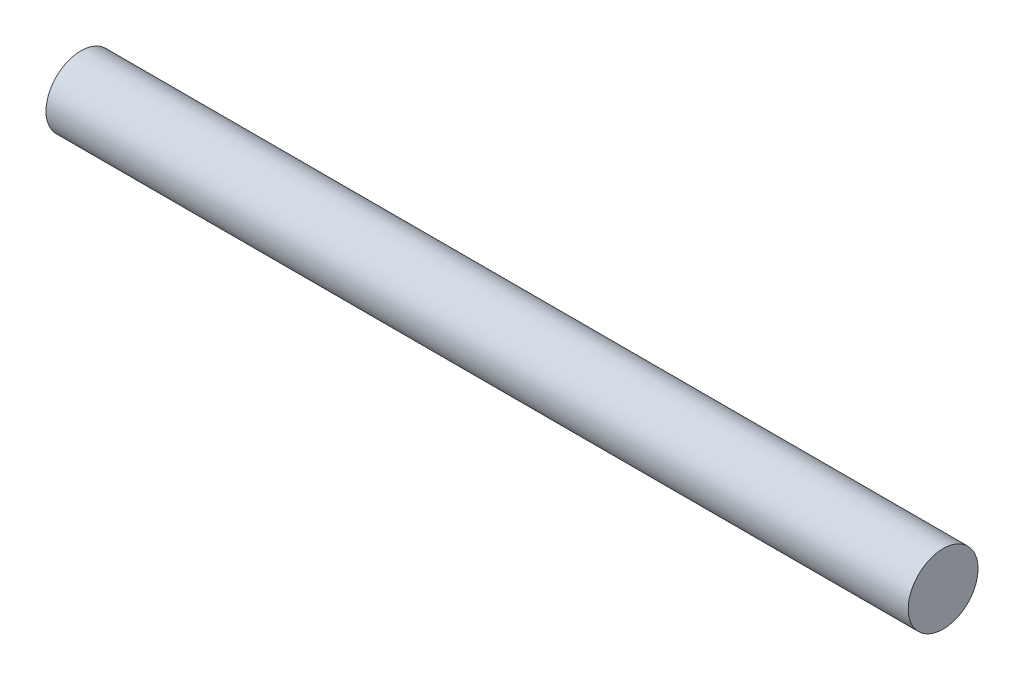
ISO-10303-21;
HEADER;
FILE_DESCRIPTION(('STEP AP214'),'2;1');
FILE_NAME('part.step','',(''),(''),'','','');
FILE_SCHEMA(('AUTOMOTIVE_DESIGN { 1 0 10303 214 1 1 1 1 }'));
ENDSEC;
DATA;
#1=APPLICATION_CONTEXT('core data for automotive mechanical design processes');
#2=APPLICATION_PROTOCOL_DEFINITION('international standard','automotive_design',2000,#1);
#3=PRODUCT_CONTEXT('',#1,'mechanical');
#4=PRODUCT('Part','Part','',(#3));
#5=PRODUCT_RELATED_PRODUCT_CATEGORY('part','',(#4));
#6=PRODUCT_DEFINITION_FORMATION('','',#4);
#7=PRODUCT_DEFINITION_CONTEXT('part definition',#1,'design');
#8=PRODUCT_DEFINITION('design','',#6,#7);
#9=PRODUCT_DEFINITION_SHAPE('','',#8);
#10=(LENGTH_UNIT() NAMED_UNIT(*) SI_UNIT(.MILLI.,.METRE.));
#11=(NAMED_UNIT(*) PLANE_ANGLE_UNIT() SI_UNIT($,.RADIAN.));
#12=(NAMED_UNIT(*) SI_UNIT($,.STERADIAN.) SOLID_ANGLE_UNIT());
#13=UNCERTAINTY_MEASURE_WITH_UNIT(LENGTH_MEASURE(1.E-05),#10,'distance_accuracy_value','');
#14=(GEOMETRIC_REPRESENTATION_CONTEXT(3) GLOBAL_UNCERTAINTY_ASSIGNED_CONTEXT((#13)) GLOBAL_UNIT_ASSIGNED_CONTEXT((#10,
#11,#12)) REPRESENTATION_CONTEXT('',''));
#15=CARTESIAN_POINT('',(0.,0.,0.));
#16=DIRECTION('',(0.,0.,1.));
#17=DIRECTION('',(1.,0.,0.));
#18=AXIS2_PLACEMENT_3D('',#15,#16,#17);
#19=CARTESIAN_POINT('',(30.861,0.,0.));
#20=DIRECTION('',(1.,0.,0.));
#21=DIRECTION('',(0.,0.,-1.));
#22=AXIS2_PLACEMENT_3D('',#19,#20,#21);
#23=PLANE('',#22);
#24=CARTESIAN_POINT('',(30.861,0.,0.));
#25=DIRECTION('',(-1.,0.,0.));
#26=DIRECTION('',(0.,0.,1.));
#27=AXIS2_PLACEMENT_3D('',#24,#25,#26);
#28=CIRCLE('',#27,2.5);
#29=CARTESIAN_POINT('',(30.861,0.,2.5));
#30=VERTEX_POINT('',#29);
#31=EDGE_CURVE('E17',#30,#30,#28,.T.);
#32=ORIENTED_EDGE('',*,*,#31,.F.);
#33=EDGE_LOOP('',(#32));
#34=FACE_BOUND('',#33,.T.);
#35=ADVANCED_FACE('F14',(#34),#23,.T.);
#36=CARTESIAN_POINT('',(-30.861,0.,0.));
#37=DIRECTION('',(1.,0.,0.));
#38=DIRECTION('',(0.,0.,-1.));
#39=AXIS2_PLACEMENT_3D('',#36,#37,#38);
#40=PLANE('',#39);
#41=CARTESIAN_POINT('',(-30.861,0.,0.));
#42=DIRECTION('',(-1.,0.,0.));
#43=DIRECTION('',(0.,0.,1.));
#44=AXIS2_PLACEMENT_3D('',#41,#42,#43);
#45=CIRCLE('',#44,2.5);
#46=CARTESIAN_POINT('',(-30.861,0.,2.5));
#47=VERTEX_POINT('',#46);
#48=EDGE_CURVE('E10',#47,#47,#45,.F.);
#49=ORIENTED_EDGE('',*,*,#48,.F.);
#50=EDGE_LOOP('',(#49));
#51=FACE_BOUND('',#50,.T.);
#52=ADVANCED_FACE('F29',(#51),#40,.F.);
#53=CARTESIAN_POINT('',(30.861,0.,0.));
#54=DIRECTION('',(-1.,0.,0.));
#55=DIRECTION('',(0.,0.,1.));
#56=AXIS2_PLACEMENT_3D('',#53,#54,#55);
#57=CYLINDRICAL_SURFACE('',#56,2.5);
#58=ORIENTED_EDGE('',*,*,#48,.T.);
#59=EDGE_LOOP('',(#58));
#60=FACE_BOUND('',#59,.T.);
#61=ORIENTED_EDGE('',*,*,#31,.T.);
#62=EDGE_LOOP('',(#61));
#63=FACE_BOUND('',#62,.T.);
#64=ADVANCED_FACE('F26',(#60,#63),#57,.T.);
#65=CLOSED_SHELL('',(#35,#52,#64));
#66=MANIFOLD_SOLID_BREP('B1',#65);
#67=ADVANCED_BREP_SHAPE_REPRESENTATION('',(#18,#66),#14);
#68=SHAPE_DEFINITION_REPRESENTATION(#9,#67);
ENDSEC;
END-ISO-10303-21;
